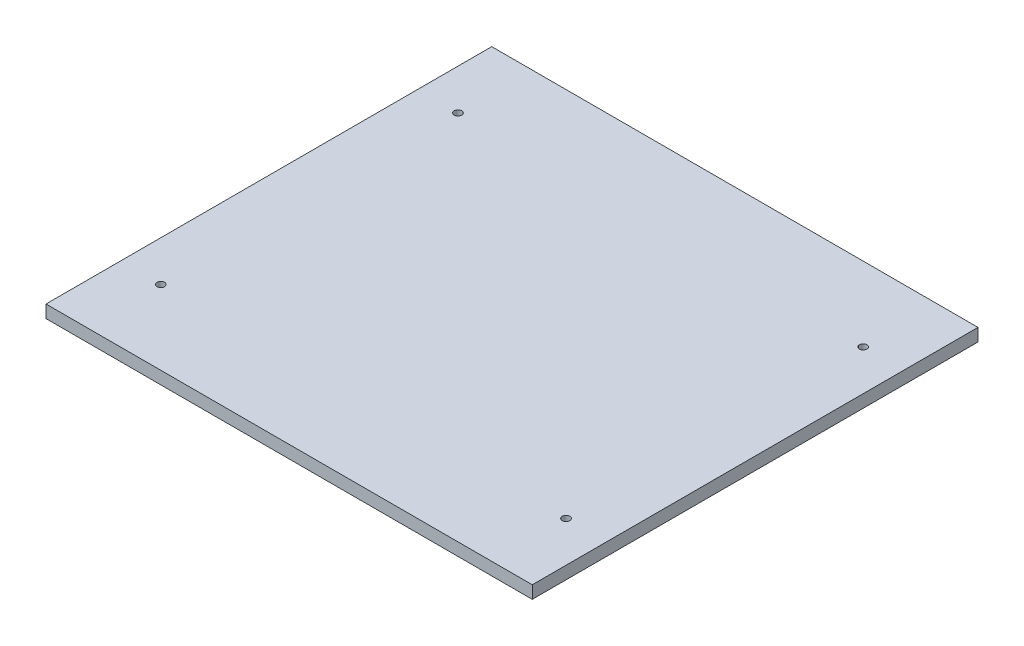
ISO-10303-21;
HEADER;
FILE_DESCRIPTION(('STEP AP214'),'2;1');
FILE_NAME('part.step','',(''),(''),'','','');
FILE_SCHEMA(('AUTOMOTIVE_DESIGN { 1 0 10303 214 1 1 1 1 }'));
ENDSEC;
DATA;
#1=APPLICATION_CONTEXT('core data for automotive mechanical design processes');
#2=APPLICATION_PROTOCOL_DEFINITION('international standard','automotive_design',2000,#1);
#3=PRODUCT_CONTEXT('',#1,'mechanical');
#4=PRODUCT('Part','Part','',(#3));
#5=PRODUCT_RELATED_PRODUCT_CATEGORY('part','',(#4));
#6=PRODUCT_DEFINITION_FORMATION('','',#4);
#7=PRODUCT_DEFINITION_CONTEXT('part definition',#1,'design');
#8=PRODUCT_DEFINITION('design','',#6,#7);
#9=PRODUCT_DEFINITION_SHAPE('','',#8);
#10=(LENGTH_UNIT() NAMED_UNIT(*) SI_UNIT(.MILLI.,.METRE.));
#11=(NAMED_UNIT(*) PLANE_ANGLE_UNIT() SI_UNIT($,.RADIAN.));
#12=(NAMED_UNIT(*) SI_UNIT($,.STERADIAN.) SOLID_ANGLE_UNIT());
#13=UNCERTAINTY_MEASURE_WITH_UNIT(LENGTH_MEASURE(1.E-05),#10,'distance_accuracy_value','');
#14=(GEOMETRIC_REPRESENTATION_CONTEXT(3) GLOBAL_UNCERTAINTY_ASSIGNED_CONTEXT((#13)) GLOBAL_UNIT_ASSIGNED_CONTEXT((#10,
#11,#12)) REPRESENTATION_CONTEXT('',''));
#15=CARTESIAN_POINT('',(0.,0.,0.));
#16=DIRECTION('',(0.,0.,1.));
#17=DIRECTION('',(1.,0.,0.));
#18=AXIS2_PLACEMENT_3D('',#15,#16,#17);
#19=CARTESIAN_POINT('',(0.,11.90625,0.));
#20=DIRECTION('',(0.,-1.,0.));
#21=DIRECTION('',(0.,0.,-1.));
#22=AXIS2_PLACEMENT_3D('',#19,#20,#21);
#23=PLANE('',#22);
#24=CARTESIAN_POINT('',(-190.5,11.90625,-139.7));
#25=DIRECTION('',(0.,1.,0.));
#26=DIRECTION('',(0.,0.,1.));
#27=AXIS2_PLACEMENT_3D('',#24,#25,#26);
#28=CIRCLE('',#27,3.571875);
#29=CARTESIAN_POINT('',(-190.5,11.90625,-136.128125));
#30=VERTEX_POINT('',#29);
#31=EDGE_CURVE('E157',#30,#30,#28,.T.);
#32=ORIENTED_EDGE('',*,*,#31,.F.);
#33=EDGE_LOOP('',(#32));
#34=FACE_BOUND('',#33,.T.);
#35=CARTESIAN_POINT('',(190.5,11.90625,139.7));
#36=DIRECTION('',(0.,1.,0.));
#37=DIRECTION('',(0.,0.,1.));
#38=AXIS2_PLACEMENT_3D('',#35,#36,#37);
#39=CIRCLE('',#38,3.571875);
#40=CARTESIAN_POINT('',(190.5,11.90625,143.271875));
#41=VERTEX_POINT('',#40);
#42=EDGE_CURVE('E141',#41,#41,#39,.T.);
#43=ORIENTED_EDGE('',*,*,#42,.F.);
#44=EDGE_LOOP('',(#43));
#45=FACE_BOUND('',#44,.T.);
#46=CARTESIAN_POINT('',(-190.5,11.90625,139.7));
#47=DIRECTION('',(0.,1.,0.));
#48=DIRECTION('',(0.,0.,1.));
#49=AXIS2_PLACEMENT_3D('',#46,#47,#48);
#50=CIRCLE('',#49,3.571875);
#51=CARTESIAN_POINT('',(-190.5,11.90625,143.271875));
#52=VERTEX_POINT('',#51);
#53=EDGE_CURVE('E133',#52,#52,#50,.T.);
#54=ORIENTED_EDGE('',*,*,#53,.F.);
#55=EDGE_LOOP('',(#54));
#56=FACE_BOUND('',#55,.T.);
#57=DIRECTION('',(0.,0.,-1.));
#58=VECTOR('',#57,1.);
#59=CARTESIAN_POINT('',(228.6,11.90625,209.55));
#60=LINE('',#59,#58);
#61=CARTESIAN_POINT('',(228.6,11.90625,209.55));
#62=VERTEX_POINT('',#61);
#63=CARTESIAN_POINT('',(228.6,11.90625,-209.55));
#64=VERTEX_POINT('',#63);
#65=EDGE_CURVE('E89',#62,#64,#60,.T.);
#66=ORIENTED_EDGE('',*,*,#65,.T.);
#67=DIRECTION('',(-1.,0.,0.));
#68=VECTOR('',#67,1.);
#69=CARTESIAN_POINT('',(-228.6,11.90625,-209.55));
#70=LINE('',#69,#68);
#71=CARTESIAN_POINT('',(-228.6,11.90625,-209.55));
#72=VERTEX_POINT('',#71);
#73=EDGE_CURVE('E84',#64,#72,#70,.T.);
#74=ORIENTED_EDGE('',*,*,#73,.T.);
#75=DIRECTION('',(0.,0.,1.));
#76=VECTOR('',#75,1.);
#77=CARTESIAN_POINT('',(-228.6,11.90625,209.55));
#78=LINE('',#77,#76);
#79=CARTESIAN_POINT('',(-228.6,11.90625,209.55));
#80=VERTEX_POINT('',#79);
#81=EDGE_CURVE('E87',#72,#80,#78,.T.);
#82=ORIENTED_EDGE('',*,*,#81,.T.);
#83=DIRECTION('',(1.,0.,0.));
#84=VECTOR('',#83,1.);
#85=CARTESIAN_POINT('',(-228.6,11.90625,209.55));
#86=LINE('',#85,#84);
#87=EDGE_CURVE('E54',#80,#62,#86,.T.);
#88=ORIENTED_EDGE('',*,*,#87,.T.);
#89=EDGE_LOOP('',(#66,#74,#82,#88));
#90=FACE_BOUND('',#89,.T.);
#91=CARTESIAN_POINT('',(190.5,11.90625,-139.7));
#92=DIRECTION('',(0.,1.,0.));
#93=DIRECTION('',(0.,0.,1.));
#94=AXIS2_PLACEMENT_3D('',#91,#92,#93);
#95=CIRCLE('',#94,3.571875);
#96=CARTESIAN_POINT('',(190.5,11.90625,-136.128125));
#97=VERTEX_POINT('',#96);
#98=EDGE_CURVE('E149',#97,#97,#95,.T.);
#99=ORIENTED_EDGE('',*,*,#98,.F.);
#100=EDGE_LOOP('',(#99));
#101=FACE_BOUND('',#100,.T.);
#102=ADVANCED_FACE('F36',(#34,#45,#56,#90,#101),#23,.F.);
#103=CARTESIAN_POINT('',(0.,0.,0.));
#104=DIRECTION('',(0.,-1.,0.));
#105=DIRECTION('',(0.,0.,-1.));
#106=AXIS2_PLACEMENT_3D('',#103,#104,#105);
#107=PLANE('',#106);
#108=CARTESIAN_POINT('',(-190.5,0.,-139.7));
#109=DIRECTION('',(0.,1.,0.));
#110=DIRECTION('',(0.,0.,1.));
#111=AXIS2_PLACEMENT_3D('',#108,#109,#110);
#112=CIRCLE('',#111,3.571875);
#113=CARTESIAN_POINT('',(-190.5,0.,-136.128125));
#114=VERTEX_POINT('',#113);
#115=EDGE_CURVE('E153',#114,#114,#112,.T.);
#116=ORIENTED_EDGE('',*,*,#115,.T.);
#117=EDGE_LOOP('',(#116));
#118=FACE_BOUND('',#117,.T.);
#119=CARTESIAN_POINT('',(190.5,0.,-139.7));
#120=DIRECTION('',(0.,1.,0.));
#121=DIRECTION('',(0.,0.,1.));
#122=AXIS2_PLACEMENT_3D('',#119,#120,#121);
#123=CIRCLE('',#122,3.571875);
#124=CARTESIAN_POINT('',(190.5,0.,-136.128125));
#125=VERTEX_POINT('',#124);
#126=EDGE_CURVE('E145',#125,#125,#123,.T.);
#127=ORIENTED_EDGE('',*,*,#126,.T.);
#128=EDGE_LOOP('',(#127));
#129=FACE_BOUND('',#128,.T.);
#130=DIRECTION('',(0.,0.,-1.));
#131=VECTOR('',#130,1.);
#132=CARTESIAN_POINT('',(228.6,0.,209.55));
#133=LINE('',#132,#131);
#134=CARTESIAN_POINT('',(228.6,0.,209.55));
#135=VERTEX_POINT('',#134);
#136=CARTESIAN_POINT('',(228.6,0.,-209.55));
#137=VERTEX_POINT('',#136);
#138=EDGE_CURVE('E106',#135,#137,#133,.T.);
#139=ORIENTED_EDGE('',*,*,#138,.F.);
#140=DIRECTION('',(1.,0.,0.));
#141=VECTOR('',#140,1.);
#142=CARTESIAN_POINT('',(-228.6,0.,209.55));
#143=LINE('',#142,#141);
#144=CARTESIAN_POINT('',(-228.6,0.,209.55));
#145=VERTEX_POINT('',#144);
#146=EDGE_CURVE('E77',#145,#135,#143,.T.);
#147=ORIENTED_EDGE('',*,*,#146,.F.);
#148=DIRECTION('',(0.,0.,1.));
#149=VECTOR('',#148,1.);
#150=CARTESIAN_POINT('',(-228.6,0.,209.55));
#151=LINE('',#150,#149);
#152=CARTESIAN_POINT('',(-228.6,0.,-209.55));
#153=VERTEX_POINT('',#152);
#154=EDGE_CURVE('E71',#153,#145,#151,.T.);
#155=ORIENTED_EDGE('',*,*,#154,.F.);
#156=DIRECTION('',(-1.,0.,0.));
#157=VECTOR('',#156,1.);
#158=CARTESIAN_POINT('',(-228.6,0.,-209.55));
#159=LINE('',#158,#157);
#160=EDGE_CURVE('E94',#137,#153,#159,.T.);
#161=ORIENTED_EDGE('',*,*,#160,.F.);
#162=EDGE_LOOP('',(#139,#147,#155,#161));
#163=FACE_BOUND('',#162,.T.);
#164=CARTESIAN_POINT('',(-190.5,0.,139.7));
#165=DIRECTION('',(0.,1.,0.));
#166=DIRECTION('',(0.,0.,1.));
#167=AXIS2_PLACEMENT_3D('',#164,#165,#166);
#168=CIRCLE('',#167,3.571875);
#169=CARTESIAN_POINT('',(-190.5,0.,143.271875));
#170=VERTEX_POINT('',#169);
#171=EDGE_CURVE('E110',#170,#170,#168,.T.);
#172=ORIENTED_EDGE('',*,*,#171,.T.);
#173=EDGE_LOOP('',(#172));
#174=FACE_BOUND('',#173,.T.);
#175=CARTESIAN_POINT('',(190.5,0.,139.7));
#176=DIRECTION('',(0.,1.,0.));
#177=DIRECTION('',(0.,0.,1.));
#178=AXIS2_PLACEMENT_3D('',#175,#176,#177);
#179=CIRCLE('',#178,3.571875);
#180=CARTESIAN_POINT('',(190.5,0.,143.271875));
#181=VERTEX_POINT('',#180);
#182=EDGE_CURVE('E137',#181,#181,#179,.T.);
#183=ORIENTED_EDGE('',*,*,#182,.T.);
#184=EDGE_LOOP('',(#183));
#185=FACE_BOUND('',#184,.T.);
#186=ADVANCED_FACE('F124',(#118,#129,#163,#174,#185),#107,.T.);
#187=CARTESIAN_POINT('',(228.6,11.90625,209.55));
#188=DIRECTION('',(-1.,0.,0.));
#189=DIRECTION('',(0.,0.,1.));
#190=AXIS2_PLACEMENT_3D('',#187,#188,#189);
#191=PLANE('',#190);
#192=ORIENTED_EDGE('',*,*,#138,.T.);
#193=DIRECTION('',(0.,-1.,0.));
#194=VECTOR('',#193,1.);
#195=CARTESIAN_POINT('',(228.6,11.90625,-209.55));
#196=LINE('',#195,#194);
#197=EDGE_CURVE('E11',#64,#137,#196,.T.);
#198=ORIENTED_EDGE('',*,*,#197,.F.);
#199=ORIENTED_EDGE('',*,*,#65,.F.);
#200=DIRECTION('',(0.,-1.,0.));
#201=VECTOR('',#200,1.);
#202=CARTESIAN_POINT('',(228.6,11.90625,209.55));
#203=LINE('',#202,#201);
#204=EDGE_CURVE('E102',#62,#135,#203,.T.);
#205=ORIENTED_EDGE('',*,*,#204,.T.);
#206=EDGE_LOOP('',(#192,#198,#199,#205));
#207=FACE_BOUND('',#206,.T.);
#208=ADVANCED_FACE('F38',(#207),#191,.F.);
#209=CARTESIAN_POINT('',(-228.6,11.90625,-209.55));
#210=DIRECTION('',(0.,0.,1.));
#211=DIRECTION('',(1.,0.,0.));
#212=AXIS2_PLACEMENT_3D('',#209,#210,#211);
#213=PLANE('',#212);
#214=ORIENTED_EDGE('',*,*,#160,.T.);
#215=DIRECTION('',(0.,-1.,0.));
#216=VECTOR('',#215,1.);
#217=CARTESIAN_POINT('',(-228.6,11.90625,-209.55));
#218=LINE('',#217,#216);
#219=EDGE_CURVE('E46',#72,#153,#218,.T.);
#220=ORIENTED_EDGE('',*,*,#219,.F.);
#221=ORIENTED_EDGE('',*,*,#73,.F.);
#222=ORIENTED_EDGE('',*,*,#197,.T.);
#223=EDGE_LOOP('',(#214,#220,#221,#222));
#224=FACE_BOUND('',#223,.T.);
#225=ADVANCED_FACE('F93',(#224),#213,.F.);
#226=CARTESIAN_POINT('',(-228.6,11.90625,209.55));
#227=DIRECTION('',(1.,0.,0.));
#228=DIRECTION('',(0.,0.,-1.));
#229=AXIS2_PLACEMENT_3D('',#226,#227,#228);
#230=PLANE('',#229);
#231=ORIENTED_EDGE('',*,*,#154,.T.);
#232=DIRECTION('',(0.,-1.,0.));
#233=VECTOR('',#232,1.);
#234=CARTESIAN_POINT('',(-228.6,11.90625,209.55));
#235=LINE('',#234,#233);
#236=EDGE_CURVE('E96',#80,#145,#235,.T.);
#237=ORIENTED_EDGE('',*,*,#236,.F.);
#238=ORIENTED_EDGE('',*,*,#81,.F.);
#239=ORIENTED_EDGE('',*,*,#219,.T.);
#240=EDGE_LOOP('',(#231,#237,#238,#239));
#241=FACE_BOUND('',#240,.T.);
#242=ADVANCED_FACE('F97',(#241),#230,.F.);
#243=CARTESIAN_POINT('',(-228.6,11.90625,209.55));
#244=DIRECTION('',(0.,0.,-1.));
#245=DIRECTION('',(-1.,0.,0.));
#246=AXIS2_PLACEMENT_3D('',#243,#244,#245);
#247=PLANE('',#246);
#248=ORIENTED_EDGE('',*,*,#146,.T.);
#249=ORIENTED_EDGE('',*,*,#204,.F.);
#250=ORIENTED_EDGE('',*,*,#87,.F.);
#251=ORIENTED_EDGE('',*,*,#236,.T.);
#252=EDGE_LOOP('',(#248,#249,#250,#251));
#253=FACE_BOUND('',#252,.T.);
#254=ADVANCED_FACE('F121',(#253),#247,.F.);
#255=CARTESIAN_POINT('',(-190.5,11.90625,139.7));
#256=DIRECTION('',(0.,1.,0.));
#257=DIRECTION('',(0.,0.,1.));
#258=AXIS2_PLACEMENT_3D('',#255,#256,#257);
#259=CYLINDRICAL_SURFACE('',#258,3.571875);
#260=ORIENTED_EDGE('',*,*,#171,.F.);
#261=EDGE_LOOP('',(#260));
#262=FACE_BOUND('',#261,.T.);
#263=ORIENTED_EDGE('',*,*,#53,.T.);
#264=EDGE_LOOP('',(#263));
#265=FACE_BOUND('',#264,.T.);
#266=ADVANCED_FACE('F172',(#262,#265),#259,.F.);
#267=CARTESIAN_POINT('',(190.5,11.90625,139.7));
#268=DIRECTION('',(0.,1.,0.));
#269=DIRECTION('',(0.,0.,1.));
#270=AXIS2_PLACEMENT_3D('',#267,#268,#269);
#271=CYLINDRICAL_SURFACE('',#270,3.571875);
#272=ORIENTED_EDGE('',*,*,#182,.F.);
#273=EDGE_LOOP('',(#272));
#274=FACE_BOUND('',#273,.T.);
#275=ORIENTED_EDGE('',*,*,#42,.T.);
#276=EDGE_LOOP('',(#275));
#277=FACE_BOUND('',#276,.T.);
#278=ADVANCED_FACE('F174',(#274,#277),#271,.F.);
#279=CARTESIAN_POINT('',(190.5,11.90625,-139.7));
#280=DIRECTION('',(0.,1.,0.));
#281=DIRECTION('',(0.,0.,1.));
#282=AXIS2_PLACEMENT_3D('',#279,#280,#281);
#283=CYLINDRICAL_SURFACE('',#282,3.571875);
#284=ORIENTED_EDGE('',*,*,#126,.F.);
#285=EDGE_LOOP('',(#284));
#286=FACE_BOUND('',#285,.T.);
#287=ORIENTED_EDGE('',*,*,#98,.T.);
#288=EDGE_LOOP('',(#287));
#289=FACE_BOUND('',#288,.T.);
#290=ADVANCED_FACE('F181',(#286,#289),#283,.F.);
#291=CARTESIAN_POINT('',(-190.5,11.90625,-139.7));
#292=DIRECTION('',(0.,1.,0.));
#293=DIRECTION('',(0.,0.,1.));
#294=AXIS2_PLACEMENT_3D('',#291,#292,#293);
#295=CYLINDRICAL_SURFACE('',#294,3.571875);
#296=ORIENTED_EDGE('',*,*,#115,.F.);
#297=EDGE_LOOP('',(#296));
#298=FACE_BOUND('',#297,.T.);
#299=ORIENTED_EDGE('',*,*,#31,.T.);
#300=EDGE_LOOP('',(#299));
#301=FACE_BOUND('',#300,.T.);
#302=ADVANCED_FACE('F163',(#298,#301),#295,.F.);
#303=CLOSED_SHELL('',(#102,#186,#208,#225,#242,#254,#266,#278,#290,#302));
#304=MANIFOLD_SOLID_BREP('B2',#303);
#305=ADVANCED_BREP_SHAPE_REPRESENTATION('',(#18,#304),#14);
#306=SHAPE_DEFINITION_REPRESENTATION(#9,#305);
ENDSEC;
END-ISO-10303-21;
